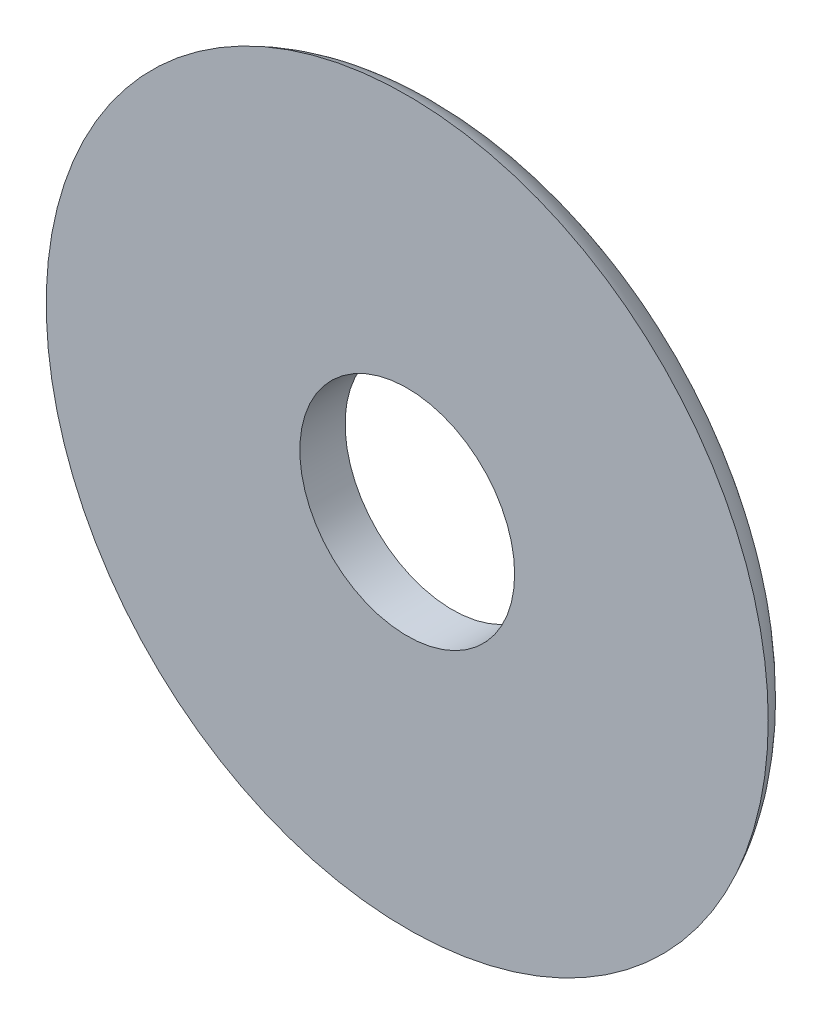
ISO-10303-21;
HEADER;
FILE_DESCRIPTION(('STEP AP214'),'2;1');
FILE_NAME('part.step','',(''),(''),'','','');
FILE_SCHEMA(('AUTOMOTIVE_DESIGN { 1 0 10303 214 1 1 1 1 }'));
ENDSEC;
DATA;
#1=APPLICATION_CONTEXT('core data for automotive mechanical design processes');
#2=APPLICATION_PROTOCOL_DEFINITION('international standard','automotive_design',2000,#1);
#3=PRODUCT_CONTEXT('',#1,'mechanical');
#4=PRODUCT('Part','Part','',(#3));
#5=PRODUCT_RELATED_PRODUCT_CATEGORY('part','',(#4));
#6=PRODUCT_DEFINITION_FORMATION('','',#4);
#7=PRODUCT_DEFINITION_CONTEXT('part definition',#1,'design');
#8=PRODUCT_DEFINITION('design','',#6,#7);
#9=PRODUCT_DEFINITION_SHAPE('','',#8);
#10=(LENGTH_UNIT() NAMED_UNIT(*) SI_UNIT(.MILLI.,.METRE.));
#11=(NAMED_UNIT(*) PLANE_ANGLE_UNIT() SI_UNIT($,.RADIAN.));
#12=(NAMED_UNIT(*) SI_UNIT($,.STERADIAN.) SOLID_ANGLE_UNIT());
#13=UNCERTAINTY_MEASURE_WITH_UNIT(LENGTH_MEASURE(1.E-05),#10,'distance_accuracy_value','');
#14=(GEOMETRIC_REPRESENTATION_CONTEXT(3) GLOBAL_UNCERTAINTY_ASSIGNED_CONTEXT((#13)) GLOBAL_UNIT_ASSIGNED_CONTEXT((#10,
#11,#12)) REPRESENTATION_CONTEXT('',''));
#15=CARTESIAN_POINT('',(0.,0.,0.));
#16=DIRECTION('',(0.,0.,1.));
#17=DIRECTION('',(1.,0.,0.));
#18=AXIS2_PLACEMENT_3D('',#15,#16,#17);
#19=CARTESIAN_POINT('',(0.,0.,6.));
#20=DIRECTION('',(0.,0.,1.));
#21=DIRECTION('',(1.,0.,0.));
#22=AXIS2_PLACEMENT_3D('',#19,#20,#21);
#23=PLANE('',#22);
#24=CARTESIAN_POINT('',(0.,0.,6.));
#25=DIRECTION('',(0.,0.,1.));
#26=DIRECTION('',(1.,0.,0.));
#27=AXIS2_PLACEMENT_3D('',#24,#25,#26);
#28=CIRCLE('',#27,14.235);
#29=CARTESIAN_POINT('',(14.235,0.,6.));
#30=VERTEX_POINT('',#29);
#31=EDGE_CURVE('E53',#30,#30,#28,.T.);
#32=ORIENTED_EDGE('',*,*,#31,.F.);
#33=EDGE_LOOP('',(#32));
#34=FACE_BOUND('',#33,.T.);
#35=CARTESIAN_POINT('',(0.,0.,6.));
#36=DIRECTION('',(0.,0.,1.));
#37=DIRECTION('',(1.,0.,0.));
#38=AXIS2_PLACEMENT_3D('',#35,#36,#37);
#39=CIRCLE('',#38,47.85);
#40=CARTESIAN_POINT('',(47.85,0.,6.));
#41=VERTEX_POINT('',#40);
#42=EDGE_CURVE('E43',#41,#41,#39,.T.);
#43=ORIENTED_EDGE('',*,*,#42,.T.);
#44=EDGE_LOOP('',(#43));
#45=FACE_BOUND('',#44,.T.);
#46=ADVANCED_FACE('F35',(#34,#45),#23,.T.);
#47=CARTESIAN_POINT('',(0.,0.,0.));
#48=DIRECTION('',(0.,0.,1.));
#49=DIRECTION('',(1.,0.,0.));
#50=AXIS2_PLACEMENT_3D('',#47,#48,#49);
#51=PLANE('',#50);
#52=CARTESIAN_POINT('',(0.,0.,0.));
#53=DIRECTION('',(0.,0.,1.));
#54=DIRECTION('',(1.,0.,0.));
#55=AXIS2_PLACEMENT_3D('',#52,#53,#54);
#56=CIRCLE('',#55,38.6848486100883);
#57=CARTESIAN_POINT('',(38.6848486100883,0.,0.));
#58=VERTEX_POINT('',#57);
#59=EDGE_CURVE('E10',#58,#58,#56,.F.);
#60=ORIENTED_EDGE('',*,*,#59,.T.);
#61=EDGE_LOOP('',(#60));
#62=FACE_BOUND('',#61,.T.);
#63=CARTESIAN_POINT('',(0.,0.,0.));
#64=DIRECTION('',(0.,0.,1.));
#65=DIRECTION('',(1.,0.,0.));
#66=AXIS2_PLACEMENT_3D('',#63,#64,#65);
#67=CIRCLE('',#66,14.235);
#68=CARTESIAN_POINT('',(14.235,0.,0.));
#69=VERTEX_POINT('',#68);
#70=EDGE_CURVE('E48',#69,#69,#67,.T.);
#71=ORIENTED_EDGE('',*,*,#70,.T.);
#72=EDGE_LOOP('',(#71));
#73=FACE_BOUND('',#72,.T.);
#74=ADVANCED_FACE('F63',(#62,#73),#51,.F.);
#75=CARTESIAN_POINT('',(0.,0.,0.));
#76=DIRECTION('',(0.,0.,1.));
#77=DIRECTION('',(1.,0.,0.));
#78=AXIS2_PLACEMENT_3D('',#75,#76,#77);
#79=CYLINDRICAL_SURFACE('',#78,14.235);
#80=ORIENTED_EDGE('',*,*,#70,.F.);
#81=EDGE_LOOP('',(#80));
#82=FACE_BOUND('',#81,.T.);
#83=ORIENTED_EDGE('',*,*,#31,.T.);
#84=EDGE_LOOP('',(#83));
#85=FACE_BOUND('',#84,.T.);
#86=ADVANCED_FACE('F60',(#82,#85),#79,.F.);
#87=CARTESIAN_POINT('',(0.,0.,10.));
#88=DIRECTION('',(0.,0.,-1.));
#89=DIRECTION('',(-1.,0.,0.));
#90=AXIS2_PLACEMENT_3D('',#87,#88,#89);
#91=TOROIDAL_SURFACE('',#90,38.6848486100883,10.);
#92=ORIENTED_EDGE('',*,*,#59,.F.);
#93=EDGE_LOOP('',(#92));
#94=FACE_BOUND('',#93,.T.);
#95=ORIENTED_EDGE('',*,*,#42,.F.);
#96=EDGE_LOOP('',(#95));
#97=FACE_BOUND('',#96,.T.);
#98=ADVANCED_FACE('F37',(#94,#97),#91,.T.);
#99=CLOSED_SHELL('',(#46,#74,#86,#98));
#100=MANIFOLD_SOLID_BREP('B2',#99);
#101=ADVANCED_BREP_SHAPE_REPRESENTATION('',(#18,#100),#14);
#102=SHAPE_DEFINITION_REPRESENTATION(#9,#101);
ENDSEC;
END-ISO-10303-21;
